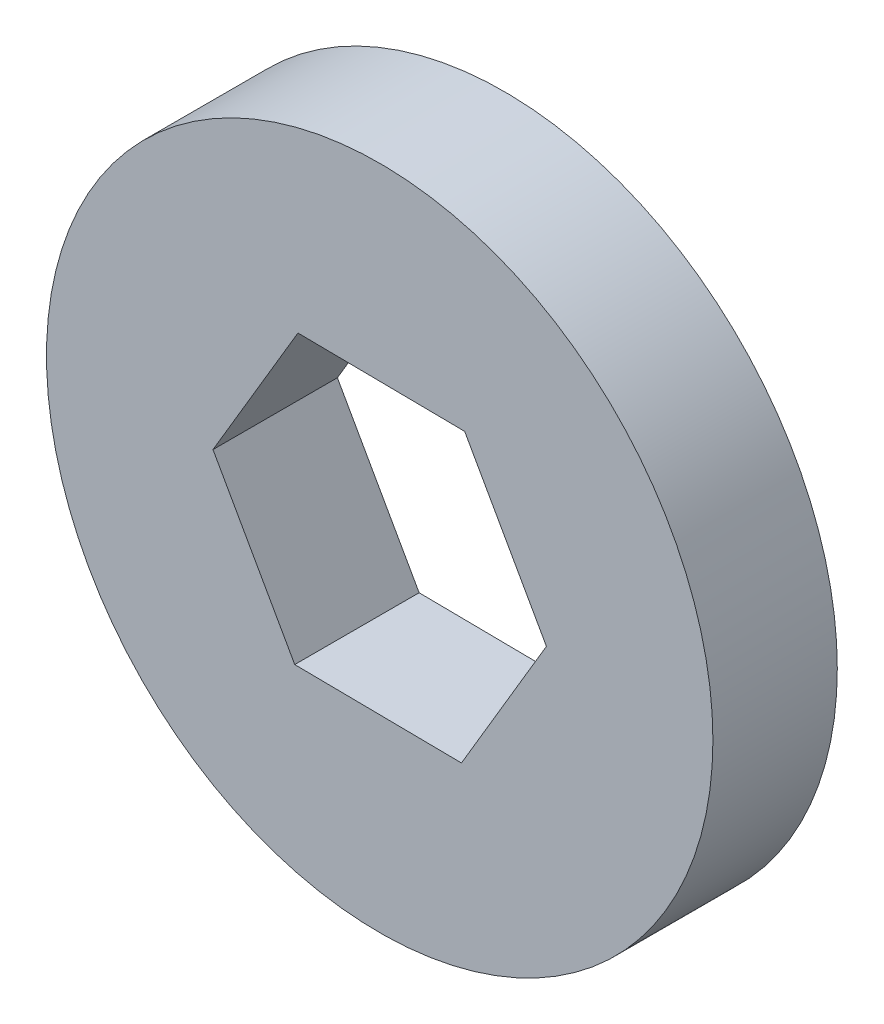
ISO-10303-21;
HEADER;
FILE_DESCRIPTION(('STEP AP214'),'2;1');
FILE_NAME('part.step','',(''),(''),'','','');
FILE_SCHEMA(('AUTOMOTIVE_DESIGN { 1 0 10303 214 1 1 1 1 }'));
ENDSEC;
DATA;
#1=APPLICATION_CONTEXT('core data for automotive mechanical design processes');
#2=APPLICATION_PROTOCOL_DEFINITION('international standard','automotive_design',2000,#1);
#3=PRODUCT_CONTEXT('',#1,'mechanical');
#4=PRODUCT('Part','Part','',(#3));
#5=PRODUCT_RELATED_PRODUCT_CATEGORY('part','',(#4));
#6=PRODUCT_DEFINITION_FORMATION('','',#4);
#7=PRODUCT_DEFINITION_CONTEXT('part definition',#1,'design');
#8=PRODUCT_DEFINITION('design','',#6,#7);
#9=PRODUCT_DEFINITION_SHAPE('','',#8);
#10=(LENGTH_UNIT() NAMED_UNIT(*) SI_UNIT(.MILLI.,.METRE.));
#11=(NAMED_UNIT(*) PLANE_ANGLE_UNIT() SI_UNIT($,.RADIAN.));
#12=(NAMED_UNIT(*) SI_UNIT($,.STERADIAN.) SOLID_ANGLE_UNIT());
#13=UNCERTAINTY_MEASURE_WITH_UNIT(LENGTH_MEASURE(1.E-05),#10,'distance_accuracy_value','');
#14=(GEOMETRIC_REPRESENTATION_CONTEXT(3) GLOBAL_UNCERTAINTY_ASSIGNED_CONTEXT((#13)) GLOBAL_UNIT_ASSIGNED_CONTEXT((#10,
#11,#12)) REPRESENTATION_CONTEXT('',''));
#15=CARTESIAN_POINT('',(0.,0.,0.));
#16=DIRECTION('',(0.,0.,1.));
#17=DIRECTION('',(1.,0.,0.));
#18=AXIS2_PLACEMENT_3D('',#15,#16,#17);
#19=CARTESIAN_POINT('',(0.,0.,5.6));
#20=DIRECTION('',(0.,0.,1.));
#21=DIRECTION('',(1.,0.,0.));
#22=AXIS2_PLACEMENT_3D('',#19,#20,#21);
#23=PLANE('',#22);
#24=CARTESIAN_POINT('',(0.,0.,5.6));
#25=DIRECTION('',(0.,0.,1.));
#26=DIRECTION('',(1.,0.,0.));
#27=AXIS2_PLACEMENT_3D('',#24,#25,#26);
#28=CIRCLE('',#27,15.);
#29=CARTESIAN_POINT('',(15.,0.,5.6));
#30=VERTEX_POINT('',#29);
#31=EDGE_CURVE('E11',#30,#30,#28,.T.);
#32=ORIENTED_EDGE('',*,*,#31,.T.);
#33=EDGE_LOOP('',(#32));
#34=FACE_BOUND('',#33,.T.);
#35=DIRECTION('',(0.509636128131462,0.860390037659184,0.));
#36=VECTOR('',#35,1.);
#37=CARTESIAN_POINT('',(3.67998463230922,-6.54148656188342,5.6));
#38=LINE('',#37,#36);
#39=CARTESIAN_POINT('',(3.67998463230922,-6.54148656188342,5.6));
#40=VERTEX_POINT('',#39);
#41=CARTESIAN_POINT('',(7.50508585726017,-0.0837831038255902,5.6));
#42=VERTEX_POINT('',#41);
#43=EDGE_CURVE('E104',#40,#42,#38,.T.);
#44=ORIENTED_EDGE('',*,*,#43,.F.);
#45=DIRECTION('',(0.999937693841634,-0.0111628148185959,0.));
#46=VECTOR('',#45,1.);
#47=CARTESIAN_POINT('',(-3.82510122495096,-6.45770345805782,5.6));
#48=LINE('',#47,#46);
#49=CARTESIAN_POINT('',(-3.82510122495096,-6.45770345805782,5.6));
#50=VERTEX_POINT('',#49);
#51=EDGE_CURVE('E96',#50,#40,#48,.T.);
#52=ORIENTED_EDGE('',*,*,#51,.F.);
#53=DIRECTION('',(0.490301565710172,-0.871552852477779,0.));
#54=VECTOR('',#53,1.);
#55=CARTESIAN_POINT('',(-7.50508585726017,0.083783103825592,5.6));
#56=LINE('',#55,#54);
#57=CARTESIAN_POINT('',(-7.50508585726017,0.0837831038255923,5.6));
#58=VERTEX_POINT('',#57);
#59=EDGE_CURVE('E124',#58,#50,#56,.T.);
#60=ORIENTED_EDGE('',*,*,#59,.F.);
#61=DIRECTION('',(-0.509636128131462,-0.860390037659184,0.));
#62=VECTOR('',#61,1.);
#63=CARTESIAN_POINT('',(-3.67998463230922,6.54148656188342,5.6));
#64=LINE('',#63,#62);
#65=CARTESIAN_POINT('',(-3.67998463230922,6.54148656188342,5.6));
#66=VERTEX_POINT('',#65);
#67=EDGE_CURVE('E122',#66,#58,#64,.T.);
#68=ORIENTED_EDGE('',*,*,#67,.F.);
#69=DIRECTION('',(-0.999937693841634,0.0111628148185958,0.));
#70=VECTOR('',#69,1.);
#71=CARTESIAN_POINT('',(3.82510122495095,6.45770345805783,5.6));
#72=LINE('',#71,#70);
#73=CARTESIAN_POINT('',(3.82510122495095,6.45770345805783,5.6));
#74=VERTEX_POINT('',#73);
#75=EDGE_CURVE('E118',#74,#66,#72,.T.);
#76=ORIENTED_EDGE('',*,*,#75,.F.);
#77=DIRECTION('',(-0.490301565710172,0.871552852477779,0.));
#78=VECTOR('',#77,1.);
#79=CARTESIAN_POINT('',(7.50508585726017,-0.0837831038255902,5.6));
#80=LINE('',#79,#78);
#81=EDGE_CURVE('E116',#42,#74,#80,.T.);
#82=ORIENTED_EDGE('',*,*,#81,.F.);
#83=EDGE_LOOP('',(#44,#52,#60,#68,#76,#82));
#84=FACE_BOUND('',#83,.T.);
#85=ADVANCED_FACE('F43',(#34,#84),#23,.T.);
#86=CARTESIAN_POINT('',(0.,0.,0.));
#87=DIRECTION('',(0.,0.,1.));
#88=DIRECTION('',(1.,0.,0.));
#89=AXIS2_PLACEMENT_3D('',#86,#87,#88);
#90=PLANE('',#89);
#91=CARTESIAN_POINT('',(0.,0.,0.));
#92=DIRECTION('',(0.,0.,1.));
#93=DIRECTION('',(1.,0.,0.));
#94=AXIS2_PLACEMENT_3D('',#91,#92,#93);
#95=CIRCLE('',#94,15.);
#96=CARTESIAN_POINT('',(15.,0.,0.));
#97=VERTEX_POINT('',#96);
#98=EDGE_CURVE('E47',#97,#97,#95,.T.);
#99=ORIENTED_EDGE('',*,*,#98,.F.);
#100=EDGE_LOOP('',(#99));
#101=FACE_BOUND('',#100,.T.);
#102=DIRECTION('',(0.999937693841634,-0.0111628148185959,0.));
#103=VECTOR('',#102,1.);
#104=CARTESIAN_POINT('',(-3.82510122495096,-6.45770345805782,0.));
#105=LINE('',#104,#103);
#106=CARTESIAN_POINT('',(-3.82510122495096,-6.45770345805782,0.));
#107=VERTEX_POINT('',#106);
#108=CARTESIAN_POINT('',(3.67998463230922,-6.54148656188342,0.));
#109=VERTEX_POINT('',#108);
#110=EDGE_CURVE('E66',#107,#109,#105,.T.);
#111=ORIENTED_EDGE('',*,*,#110,.T.);
#112=DIRECTION('',(0.509636128131462,0.860390037659184,0.));
#113=VECTOR('',#112,1.);
#114=CARTESIAN_POINT('',(3.67998463230922,-6.54148656188342,0.));
#115=LINE('',#114,#113);
#116=CARTESIAN_POINT('',(7.50508585726017,-0.0837831038255902,0.));
#117=VERTEX_POINT('',#116);
#118=EDGE_CURVE('E111',#109,#117,#115,.T.);
#119=ORIENTED_EDGE('',*,*,#118,.T.);
#120=DIRECTION('',(-0.490301565710172,0.871552852477779,0.));
#121=VECTOR('',#120,1.);
#122=CARTESIAN_POINT('',(7.50508585726017,-0.0837831038255902,0.));
#123=LINE('',#122,#121);
#124=CARTESIAN_POINT('',(3.82510122495095,6.45770345805783,0.));
#125=VERTEX_POINT('',#124);
#126=EDGE_CURVE('E128',#117,#125,#123,.T.);
#127=ORIENTED_EDGE('',*,*,#126,.T.);
#128=DIRECTION('',(-0.999937693841634,0.0111628148185958,0.));
#129=VECTOR('',#128,1.);
#130=CARTESIAN_POINT('',(3.82510122495095,6.45770345805783,0.));
#131=LINE('',#130,#129);
#132=CARTESIAN_POINT('',(-3.67998463230922,6.54148656188342,0.));
#133=VERTEX_POINT('',#132);
#134=EDGE_CURVE('E131',#125,#133,#131,.T.);
#135=ORIENTED_EDGE('',*,*,#134,.T.);
#136=DIRECTION('',(-0.509636128131462,-0.860390037659184,0.));
#137=VECTOR('',#136,1.);
#138=CARTESIAN_POINT('',(-3.67998463230922,6.54148656188342,0.));
#139=LINE('',#138,#137);
#140=CARTESIAN_POINT('',(-7.50508585726017,0.083783103825592,0.));
#141=VERTEX_POINT('',#140);
#142=EDGE_CURVE('E134',#133,#141,#139,.T.);
#143=ORIENTED_EDGE('',*,*,#142,.T.);
#144=DIRECTION('',(0.490301565710172,-0.871552852477779,0.));
#145=VECTOR('',#144,1.);
#146=CARTESIAN_POINT('',(-7.50508585726017,0.083783103825592,0.));
#147=LINE('',#146,#145);
#148=EDGE_CURVE('E105',#141,#107,#147,.T.);
#149=ORIENTED_EDGE('',*,*,#148,.T.);
#150=EDGE_LOOP('',(#111,#119,#127,#135,#143,#149));
#151=FACE_BOUND('',#150,.T.);
#152=ADVANCED_FACE('F151',(#101,#151),#90,.F.);
#153=CARTESIAN_POINT('',(0.,0.,5.6));
#154=DIRECTION('',(0.,0.,-1.));
#155=DIRECTION('',(-1.,0.,0.));
#156=AXIS2_PLACEMENT_3D('',#153,#154,#155);
#157=CYLINDRICAL_SURFACE('',#156,15.);
#158=ORIENTED_EDGE('',*,*,#31,.F.);
#159=EDGE_LOOP('',(#158));
#160=FACE_BOUND('',#159,.T.);
#161=ORIENTED_EDGE('',*,*,#98,.T.);
#162=EDGE_LOOP('',(#161));
#163=FACE_BOUND('',#162,.T.);
#164=ADVANCED_FACE('F45',(#160,#163),#157,.T.);
#165=CARTESIAN_POINT('',(-3.82510122495096,-6.45770345805782,5.6));
#166=DIRECTION('',(0.0111628148185959,0.999937693841634,0.));
#167=DIRECTION('',(-0.999937693841634,0.0111628148185959,0.));
#168=AXIS2_PLACEMENT_3D('',#165,#166,#167);
#169=PLANE('',#168);
#170=ORIENTED_EDGE('',*,*,#110,.F.);
#171=DIRECTION('',(0.,0.,-1.));
#172=VECTOR('',#171,1.);
#173=CARTESIAN_POINT('',(-3.82510122495096,-6.45770345805782,5.6));
#174=LINE('',#173,#172);
#175=EDGE_CURVE('E100',#50,#107,#174,.T.);
#176=ORIENTED_EDGE('',*,*,#175,.F.);
#177=ORIENTED_EDGE('',*,*,#51,.T.);
#178=DIRECTION('',(0.,0.,-1.));
#179=VECTOR('',#178,1.);
#180=CARTESIAN_POINT('',(3.67998463230922,-6.54148656188342,5.6));
#181=LINE('',#180,#179);
#182=EDGE_CURVE('E99',#40,#109,#181,.T.);
#183=ORIENTED_EDGE('',*,*,#182,.T.);
#184=EDGE_LOOP('',(#170,#176,#177,#183));
#185=FACE_BOUND('',#184,.T.);
#186=ADVANCED_FACE('F98',(#185),#169,.T.);
#187=CARTESIAN_POINT('',(3.67998463230922,-6.54148656188342,5.6));
#188=DIRECTION('',(-0.860390037659184,0.509636128131462,0.));
#189=DIRECTION('',(-0.509636128131462,-0.860390037659184,0.));
#190=AXIS2_PLACEMENT_3D('',#187,#188,#189);
#191=PLANE('',#190);
#192=ORIENTED_EDGE('',*,*,#118,.F.);
#193=ORIENTED_EDGE('',*,*,#182,.F.);
#194=ORIENTED_EDGE('',*,*,#43,.T.);
#195=DIRECTION('',(0.,0.,-1.));
#196=VECTOR('',#195,1.);
#197=CARTESIAN_POINT('',(7.50508585726017,-0.0837831038255902,5.6));
#198=LINE('',#197,#196);
#199=EDGE_CURVE('E112',#42,#117,#198,.T.);
#200=ORIENTED_EDGE('',*,*,#199,.T.);
#201=EDGE_LOOP('',(#192,#193,#194,#200));
#202=FACE_BOUND('',#201,.T.);
#203=ADVANCED_FACE('F108',(#202),#191,.T.);
#204=CARTESIAN_POINT('',(7.50508585726017,-0.0837831038255902,5.6));
#205=DIRECTION('',(-0.871552852477779,-0.490301565710172,0.));
#206=DIRECTION('',(0.490301565710172,-0.871552852477779,0.));
#207=AXIS2_PLACEMENT_3D('',#204,#205,#206);
#208=PLANE('',#207);
#209=ORIENTED_EDGE('',*,*,#126,.F.);
#210=ORIENTED_EDGE('',*,*,#199,.F.);
#211=ORIENTED_EDGE('',*,*,#81,.T.);
#212=DIRECTION('',(0.,0.,-1.));
#213=VECTOR('',#212,1.);
#214=CARTESIAN_POINT('',(3.82510122495095,6.45770345805783,5.6));
#215=LINE('',#214,#213);
#216=EDGE_CURVE('E143',#74,#125,#215,.T.);
#217=ORIENTED_EDGE('',*,*,#216,.T.);
#218=EDGE_LOOP('',(#209,#210,#211,#217));
#219=FACE_BOUND('',#218,.T.);
#220=ADVANCED_FACE('F147',(#219),#208,.T.);
#221=CARTESIAN_POINT('',(3.82510122495095,6.45770345805783,5.6));
#222=DIRECTION('',(-0.0111628148185958,-0.999937693841634,0.));
#223=DIRECTION('',(0.999937693841634,-0.0111628148185958,0.));
#224=AXIS2_PLACEMENT_3D('',#221,#222,#223);
#225=PLANE('',#224);
#226=ORIENTED_EDGE('',*,*,#134,.F.);
#227=ORIENTED_EDGE('',*,*,#216,.F.);
#228=ORIENTED_EDGE('',*,*,#75,.T.);
#229=DIRECTION('',(0.,0.,-1.));
#230=VECTOR('',#229,1.);
#231=CARTESIAN_POINT('',(-3.67998463230922,6.54148656188342,5.6));
#232=LINE('',#231,#230);
#233=EDGE_CURVE('E141',#66,#133,#232,.T.);
#234=ORIENTED_EDGE('',*,*,#233,.T.);
#235=EDGE_LOOP('',(#226,#227,#228,#234));
#236=FACE_BOUND('',#235,.T.);
#237=ADVANCED_FACE('F159',(#236),#225,.T.);
#238=CARTESIAN_POINT('',(-3.67998463230922,6.54148656188342,5.6));
#239=DIRECTION('',(0.860390037659184,-0.509636128131462,0.));
#240=DIRECTION('',(0.509636128131462,0.860390037659184,0.));
#241=AXIS2_PLACEMENT_3D('',#238,#239,#240);
#242=PLANE('',#241);
#243=ORIENTED_EDGE('',*,*,#142,.F.);
#244=ORIENTED_EDGE('',*,*,#233,.F.);
#245=ORIENTED_EDGE('',*,*,#67,.T.);
#246=DIRECTION('',(0.,0.,-1.));
#247=VECTOR('',#246,1.);
#248=CARTESIAN_POINT('',(-7.50508585726017,0.083783103825592,5.6));
#249=LINE('',#248,#247);
#250=EDGE_CURVE('E58',#58,#141,#249,.T.);
#251=ORIENTED_EDGE('',*,*,#250,.T.);
#252=EDGE_LOOP('',(#243,#244,#245,#251));
#253=FACE_BOUND('',#252,.T.);
#254=ADVANCED_FACE('F157',(#253),#242,.T.);
#255=CARTESIAN_POINT('',(-7.50508585726017,0.083783103825592,5.6));
#256=DIRECTION('',(0.871552852477779,0.490301565710172,0.));
#257=DIRECTION('',(-0.490301565710172,0.871552852477779,0.));
#258=AXIS2_PLACEMENT_3D('',#255,#256,#257);
#259=PLANE('',#258);
#260=ORIENTED_EDGE('',*,*,#148,.F.);
#261=ORIENTED_EDGE('',*,*,#250,.F.);
#262=ORIENTED_EDGE('',*,*,#59,.T.);
#263=ORIENTED_EDGE('',*,*,#175,.T.);
#264=EDGE_LOOP('',(#260,#261,#262,#263));
#265=FACE_BOUND('',#264,.T.);
#266=ADVANCED_FACE('F153',(#265),#259,.T.);
#267=CLOSED_SHELL('',(#85,#152,#164,#186,#203,#220,#237,#254,#266));
#268=MANIFOLD_SOLID_BREP('B2',#267);
#269=ADVANCED_BREP_SHAPE_REPRESENTATION('',(#18,#268),#14);
#270=SHAPE_DEFINITION_REPRESENTATION(#9,#269);
ENDSEC;
END-ISO-10303-21;
